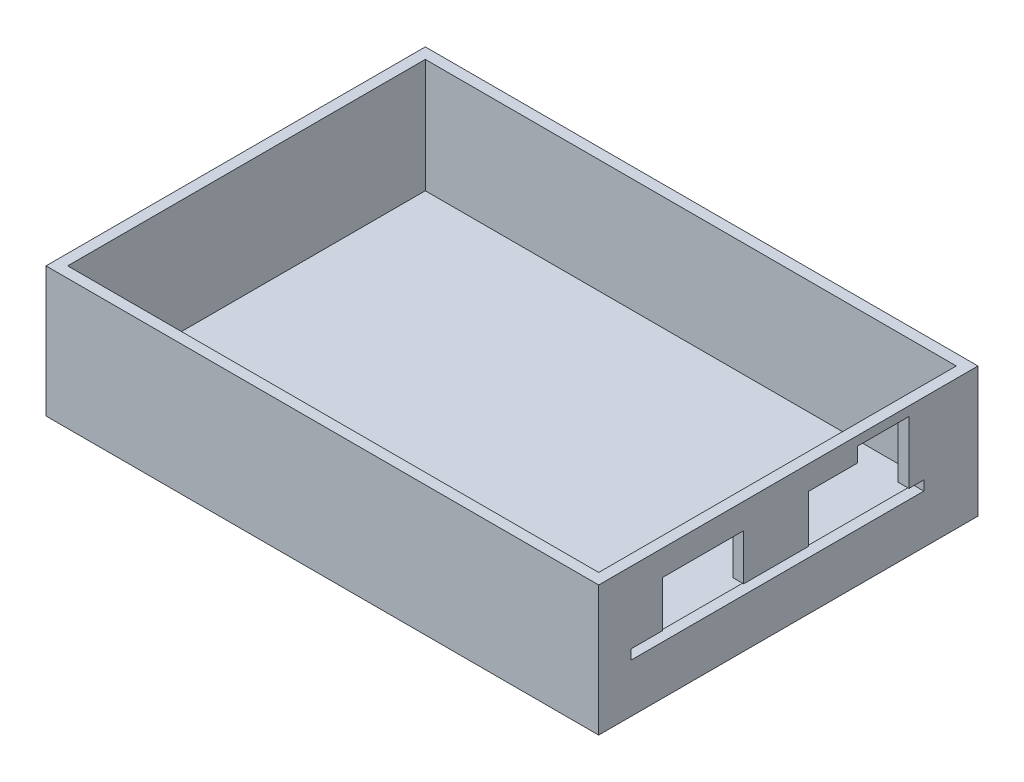
ISO-10303-21;
HEADER;
FILE_DESCRIPTION(('STEP AP214'),'2;1');
FILE_NAME('part.step','',(''),(''),'','','');
FILE_SCHEMA(('AUTOMOTIVE_DESIGN { 1 0 10303 214 1 1 1 1 }'));
ENDSEC;
DATA;
#1=APPLICATION_CONTEXT('core data for automotive mechanical design processes');
#2=APPLICATION_PROTOCOL_DEFINITION('international standard','automotive_design',2000,#1);
#3=PRODUCT_CONTEXT('',#1,'mechanical');
#4=PRODUCT('Part','Part','',(#3));
#5=PRODUCT_RELATED_PRODUCT_CATEGORY('part','',(#4));
#6=PRODUCT_DEFINITION_FORMATION('','',#4);
#7=PRODUCT_DEFINITION_CONTEXT('part definition',#1,'design');
#8=PRODUCT_DEFINITION('design','',#6,#7);
#9=PRODUCT_DEFINITION_SHAPE('','',#8);
#10=(LENGTH_UNIT() NAMED_UNIT(*) SI_UNIT(.MILLI.,.METRE.));
#11=(NAMED_UNIT(*) PLANE_ANGLE_UNIT() SI_UNIT($,.RADIAN.));
#12=(NAMED_UNIT(*) SI_UNIT($,.STERADIAN.) SOLID_ANGLE_UNIT());
#13=UNCERTAINTY_MEASURE_WITH_UNIT(LENGTH_MEASURE(1.E-05),#10,'distance_accuracy_value','');
#14=(GEOMETRIC_REPRESENTATION_CONTEXT(3) GLOBAL_UNCERTAINTY_ASSIGNED_CONTEXT((#13)) GLOBAL_UNIT_ASSIGNED_CONTEXT((#10,
#11,#12)) REPRESENTATION_CONTEXT('',''));
#15=CARTESIAN_POINT('',(0.,0.,0.));
#16=DIRECTION('',(0.,0.,1.));
#17=DIRECTION('',(1.,0.,0.));
#18=AXIS2_PLACEMENT_3D('',#15,#16,#17);
#19=CARTESIAN_POINT('',(0.,24.,0.));
#20=DIRECTION('',(1.,0.,0.));
#21=DIRECTION('',(0.,0.,-1.));
#22=AXIS2_PLACEMENT_3D('',#19,#20,#21);
#23=PLANE('',#22);
#24=DIRECTION('',(0.,0.,1.));
#25=VECTOR('',#24,1.);
#26=CARTESIAN_POINT('',(0.,0.,0.));
#27=LINE('',#26,#25);
#28=CARTESIAN_POINT('',(0.,0.,-70.));
#29=VERTEX_POINT('',#28);
#30=CARTESIAN_POINT('',(0.,0.,0.));
#31=VERTEX_POINT('',#30);
#32=EDGE_CURVE('E297',#29,#31,#27,.T.);
#33=ORIENTED_EDGE('',*,*,#32,.T.);
#34=DIRECTION('',(0.,-1.,0.));
#35=VECTOR('',#34,1.);
#36=CARTESIAN_POINT('',(0.,24.,0.));
#37=LINE('',#36,#35);
#38=CARTESIAN_POINT('',(0.,24.,0.));
#39=VERTEX_POINT('',#38);
#40=EDGE_CURVE('E12',#39,#31,#37,.T.);
#41=ORIENTED_EDGE('',*,*,#40,.F.);
#42=DIRECTION('',(0.,0.,1.));
#43=VECTOR('',#42,1.);
#44=CARTESIAN_POINT('',(0.,24.,0.));
#45=LINE('',#44,#43);
#46=CARTESIAN_POINT('',(0.,24.,-70.));
#47=VERTEX_POINT('',#46);
#48=EDGE_CURVE('E298',#47,#39,#45,.T.);
#49=ORIENTED_EDGE('',*,*,#48,.F.);
#50=DIRECTION('',(0.,-1.,0.));
#51=VECTOR('',#50,1.);
#52=CARTESIAN_POINT('',(0.,24.,-70.));
#53=LINE('',#52,#51);
#54=EDGE_CURVE('E308',#47,#29,#53,.T.);
#55=ORIENTED_EDGE('',*,*,#54,.T.);
#56=EDGE_LOOP('',(#33,#41,#49,#55));
#57=FACE_BOUND('',#56,.T.);
#58=ADVANCED_FACE('F35',(#57),#23,.F.);
#59=CARTESIAN_POINT('',(0.,24.,0.));
#60=DIRECTION('',(0.,0.,-1.));
#61=DIRECTION('',(-1.,0.,0.));
#62=AXIS2_PLACEMENT_3D('',#59,#60,#61);
#63=PLANE('',#62);
#64=DIRECTION('',(1.,0.,0.));
#65=VECTOR('',#64,1.);
#66=CARTESIAN_POINT('',(0.,0.,0.));
#67=LINE('',#66,#65);
#68=CARTESIAN_POINT('',(102.,0.,0.));
#69=VERTEX_POINT('',#68);
#70=EDGE_CURVE('E311',#31,#69,#67,.T.);
#71=ORIENTED_EDGE('',*,*,#70,.T.);
#72=DIRECTION('',(0.,-1.,0.));
#73=VECTOR('',#72,1.);
#74=CARTESIAN_POINT('',(102.,24.,0.));
#75=LINE('',#74,#73);
#76=CARTESIAN_POINT('',(102.,24.,0.));
#77=VERTEX_POINT('',#76);
#78=EDGE_CURVE('E42',#77,#69,#75,.T.);
#79=ORIENTED_EDGE('',*,*,#78,.F.);
#80=DIRECTION('',(1.,0.,0.));
#81=VECTOR('',#80,1.);
#82=CARTESIAN_POINT('',(0.,24.,0.));
#83=LINE('',#82,#81);
#84=EDGE_CURVE('E301',#39,#77,#83,.T.);
#85=ORIENTED_EDGE('',*,*,#84,.F.);
#86=ORIENTED_EDGE('',*,*,#40,.T.);
#87=EDGE_LOOP('',(#71,#79,#85,#86));
#88=FACE_BOUND('',#87,.T.);
#89=ADVANCED_FACE('F339',(#88),#63,.F.);
#90=CARTESIAN_POINT('',(102.,24.,0.));
#91=DIRECTION('',(-1.,0.,0.));
#92=DIRECTION('',(0.,0.,1.));
#93=AXIS2_PLACEMENT_3D('',#90,#91,#92);
#94=PLANE('',#93);
#95=DIRECTION('',(0.,0.,-1.));
#96=VECTOR('',#95,1.);
#97=CARTESIAN_POINT('',(102.,9.,-6.00000000000001));
#98=LINE('',#97,#96);
#99=CARTESIAN_POINT('',(102.,9.,-6.00000000000001));
#100=VERTEX_POINT('',#99);
#101=CARTESIAN_POINT('',(102.,9.,-60.));
#102=VERTEX_POINT('',#101);
#103=EDGE_CURVE('E195',#100,#102,#98,.T.);
#104=ORIENTED_EDGE('',*,*,#103,.F.);
#105=DIRECTION('',(0.,-1.,0.));
#106=VECTOR('',#105,1.);
#107=CARTESIAN_POINT('',(102.,10.8,-6.));
#108=LINE('',#107,#106);
#109=CARTESIAN_POINT('',(102.,10.8,-6.));
#110=VERTEX_POINT('',#109);
#111=EDGE_CURVE('E49',#110,#100,#108,.T.);
#112=ORIENTED_EDGE('',*,*,#111,.F.);
#113=DIRECTION('',(0.,0.,1.));
#114=VECTOR('',#113,1.);
#115=CARTESIAN_POINT('',(102.,10.8,-11.75));
#116=LINE('',#115,#114);
#117=CARTESIAN_POINT('',(102.,10.8,-11.75));
#118=VERTEX_POINT('',#117);
#119=EDGE_CURVE('E235',#118,#110,#116,.T.);
#120=ORIENTED_EDGE('',*,*,#119,.F.);
#121=DIRECTION('',(0.,-1.,0.));
#122=VECTOR('',#121,1.);
#123=CARTESIAN_POINT('',(102.,19.3,-11.75));
#124=LINE('',#123,#122);
#125=CARTESIAN_POINT('',(102.,19.3,-11.75));
#126=VERTEX_POINT('',#125);
#127=EDGE_CURVE('E232',#126,#118,#124,.T.);
#128=ORIENTED_EDGE('',*,*,#127,.F.);
#129=DIRECTION('',(0.,0.,1.));
#130=VECTOR('',#129,1.);
#131=CARTESIAN_POINT('',(102.,19.3,-26.75));
#132=LINE('',#131,#130);
#133=CARTESIAN_POINT('',(102.,19.3,-26.75));
#134=VERTEX_POINT('',#133);
#135=EDGE_CURVE('E229',#134,#126,#132,.T.);
#136=ORIENTED_EDGE('',*,*,#135,.F.);
#137=DIRECTION('',(0.,1.,0.));
#138=VECTOR('',#137,1.);
#139=CARTESIAN_POINT('',(102.,10.8,-26.75));
#140=LINE('',#139,#138);
#141=CARTESIAN_POINT('',(102.,10.8,-26.75));
#142=VERTEX_POINT('',#141);
#143=EDGE_CURVE('E226',#142,#134,#140,.T.);
#144=ORIENTED_EDGE('',*,*,#143,.F.);
#145=DIRECTION('',(0.,0.,1.));
#146=VECTOR('',#145,1.);
#147=CARTESIAN_POINT('',(102.,10.8,-38.75));
#148=LINE('',#147,#146);
#149=CARTESIAN_POINT('',(102.,10.8,-38.75));
#150=VERTEX_POINT('',#149);
#151=EDGE_CURVE('E223',#150,#142,#148,.T.);
#152=ORIENTED_EDGE('',*,*,#151,.F.);
#153=DIRECTION('',(0.,-1.,0.));
#154=VECTOR('',#153,1.);
#155=CARTESIAN_POINT('',(102.,19.6,-38.75));
#156=LINE('',#155,#154);
#157=CARTESIAN_POINT('',(102.,19.6,-38.75));
#158=VERTEX_POINT('',#157);
#159=EDGE_CURVE('E220',#158,#150,#156,.T.);
#160=ORIENTED_EDGE('',*,*,#159,.F.);
#161=DIRECTION('',(0.,0.,1.));
#162=VECTOR('',#161,1.);
#163=CARTESIAN_POINT('',(102.,19.6,-47.75));
#164=LINE('',#163,#162);
#165=CARTESIAN_POINT('',(102.,19.6,-47.75));
#166=VERTEX_POINT('',#165);
#167=EDGE_CURVE('E217',#166,#158,#164,.T.);
#168=ORIENTED_EDGE('',*,*,#167,.F.);
#169=DIRECTION('',(0.,-1.,0.));
#170=VECTOR('',#169,1.);
#171=CARTESIAN_POINT('',(102.,22.3,-47.75));
#172=LINE('',#171,#170);
#173=CARTESIAN_POINT('',(102.,22.3,-47.75));
#174=VERTEX_POINT('',#173);
#175=EDGE_CURVE('E214',#174,#166,#172,.T.);
#176=ORIENTED_EDGE('',*,*,#175,.F.);
#177=DIRECTION('',(0.,0.,1.));
#178=VECTOR('',#177,1.);
#179=CARTESIAN_POINT('',(102.,22.3,-57.25));
#180=LINE('',#179,#178);
#181=CARTESIAN_POINT('',(102.,22.3,-57.25));
#182=VERTEX_POINT('',#181);
#183=EDGE_CURVE('E211',#182,#174,#180,.T.);
#184=ORIENTED_EDGE('',*,*,#183,.F.);
#185=DIRECTION('',(0.,1.,0.));
#186=VECTOR('',#185,1.);
#187=CARTESIAN_POINT('',(102.,10.8,-57.25));
#188=LINE('',#187,#186);
#189=CARTESIAN_POINT('',(102.,10.8,-57.25));
#190=VERTEX_POINT('',#189);
#191=EDGE_CURVE('E205',#190,#182,#188,.T.);
#192=ORIENTED_EDGE('',*,*,#191,.F.);
#193=DIRECTION('',(0.,0.,1.));
#194=VECTOR('',#193,1.);
#195=CARTESIAN_POINT('',(102.,10.8,-60.));
#196=LINE('',#195,#194);
#197=CARTESIAN_POINT('',(102.,10.8,-60.));
#198=VERTEX_POINT('',#197);
#199=EDGE_CURVE('E203',#198,#190,#196,.T.);
#200=ORIENTED_EDGE('',*,*,#199,.F.);
#201=DIRECTION('',(0.,1.,0.));
#202=VECTOR('',#201,1.);
#203=CARTESIAN_POINT('',(102.,9.,-60.));
#204=LINE('',#203,#202);
#205=EDGE_CURVE('E186',#102,#198,#204,.T.);
#206=ORIENTED_EDGE('',*,*,#205,.F.);
#207=EDGE_LOOP('',(#104,#112,#120,#128,#136,#144,#152,#160,#168,#176,#184,#192,#200,#206));
#208=FACE_BOUND('',#207,.T.);
#209=DIRECTION('',(0.,0.,-1.));
#210=VECTOR('',#209,1.);
#211=CARTESIAN_POINT('',(102.,0.,0.));
#212=LINE('',#211,#210);
#213=CARTESIAN_POINT('',(102.,0.,-70.));
#214=VERTEX_POINT('',#213);
#215=EDGE_CURVE('E313',#69,#214,#212,.T.);
#216=ORIENTED_EDGE('',*,*,#215,.T.);
#217=DIRECTION('',(0.,-1.,0.));
#218=VECTOR('',#217,1.);
#219=CARTESIAN_POINT('',(102.,24.,-70.));
#220=LINE('',#219,#218);
#221=CARTESIAN_POINT('',(102.,24.,-70.));
#222=VERTEX_POINT('',#221);
#223=EDGE_CURVE('E318',#222,#214,#220,.T.);
#224=ORIENTED_EDGE('',*,*,#223,.F.);
#225=DIRECTION('',(0.,0.,-1.));
#226=VECTOR('',#225,1.);
#227=CARTESIAN_POINT('',(102.,24.,0.));
#228=LINE('',#227,#226);
#229=EDGE_CURVE('E304',#77,#222,#228,.T.);
#230=ORIENTED_EDGE('',*,*,#229,.F.);
#231=ORIENTED_EDGE('',*,*,#78,.T.);
#232=EDGE_LOOP('',(#216,#224,#230,#231));
#233=FACE_BOUND('',#232,.T.);
#234=ADVANCED_FACE('F199',(#208,#233),#94,.F.);
#235=CARTESIAN_POINT('',(0.,24.,-70.));
#236=DIRECTION('',(0.,0.,1.));
#237=DIRECTION('',(1.,0.,0.));
#238=AXIS2_PLACEMENT_3D('',#235,#236,#237);
#239=PLANE('',#238);
#240=DIRECTION('',(-1.,0.,0.));
#241=VECTOR('',#240,1.);
#242=CARTESIAN_POINT('',(0.,0.,-70.));
#243=LINE('',#242,#241);
#244=EDGE_CURVE('E302',#214,#29,#243,.T.);
#245=ORIENTED_EDGE('',*,*,#244,.T.);
#246=ORIENTED_EDGE('',*,*,#54,.F.);
#247=DIRECTION('',(-1.,0.,0.));
#248=VECTOR('',#247,1.);
#249=CARTESIAN_POINT('',(0.,24.,-70.));
#250=LINE('',#249,#248);
#251=EDGE_CURVE('E306',#222,#47,#250,.T.);
#252=ORIENTED_EDGE('',*,*,#251,.F.);
#253=ORIENTED_EDGE('',*,*,#223,.T.);
#254=EDGE_LOOP('',(#245,#246,#252,#253));
#255=FACE_BOUND('',#254,.T.);
#256=ADVANCED_FACE('F332',(#255),#239,.F.);
#257=CARTESIAN_POINT('',(0.,24.,0.));
#258=DIRECTION('',(0.,-1.,0.));
#259=DIRECTION('',(0.,0.,-1.));
#260=AXIS2_PLACEMENT_3D('',#257,#258,#259);
#261=PLANE('',#260);
#262=DIRECTION('',(0.,0.,-1.));
#263=VECTOR('',#262,1.);
#264=CARTESIAN_POINT('',(100.,24.,-2.));
#265=LINE('',#264,#263);
#266=CARTESIAN_POINT('',(100.,24.,-2.));
#267=VERTEX_POINT('',#266);
#268=CARTESIAN_POINT('',(100.,24.,-68.));
#269=VERTEX_POINT('',#268);
#270=EDGE_CURVE('E269',#267,#269,#265,.T.);
#271=ORIENTED_EDGE('',*,*,#270,.F.);
#272=DIRECTION('',(1.,0.,0.));
#273=VECTOR('',#272,1.);
#274=CARTESIAN_POINT('',(2.,24.,-2.));
#275=LINE('',#274,#273);
#276=CARTESIAN_POINT('',(2.,24.,-2.));
#277=VERTEX_POINT('',#276);
#278=EDGE_CURVE('E272',#277,#267,#275,.T.);
#279=ORIENTED_EDGE('',*,*,#278,.F.);
#280=DIRECTION('',(0.,0.,1.));
#281=VECTOR('',#280,1.);
#282=CARTESIAN_POINT('',(2.,24.,-2.));
#283=LINE('',#282,#281);
#284=CARTESIAN_POINT('',(2.,24.,-68.));
#285=VERTEX_POINT('',#284);
#286=EDGE_CURVE('E264',#285,#277,#283,.T.);
#287=ORIENTED_EDGE('',*,*,#286,.F.);
#288=DIRECTION('',(-1.,0.,0.));
#289=VECTOR('',#288,1.);
#290=CARTESIAN_POINT('',(2.,24.,-68.));
#291=LINE('',#290,#289);
#292=EDGE_CURVE('E266',#269,#285,#291,.T.);
#293=ORIENTED_EDGE('',*,*,#292,.F.);
#294=EDGE_LOOP('',(#271,#279,#287,#293));
#295=FACE_BOUND('',#294,.T.);
#296=ORIENTED_EDGE('',*,*,#48,.T.);
#297=ORIENTED_EDGE('',*,*,#84,.T.);
#298=ORIENTED_EDGE('',*,*,#229,.T.);
#299=ORIENTED_EDGE('',*,*,#251,.T.);
#300=EDGE_LOOP('',(#296,#297,#298,#299));
#301=FACE_BOUND('',#300,.T.);
#302=ADVANCED_FACE('F338',(#295,#301),#261,.F.);
#303=CARTESIAN_POINT('',(0.,0.,0.));
#304=DIRECTION('',(0.,-1.,0.));
#305=DIRECTION('',(0.,0.,-1.));
#306=AXIS2_PLACEMENT_3D('',#303,#304,#305);
#307=PLANE('',#306);
#308=ORIENTED_EDGE('',*,*,#32,.F.);
#309=ORIENTED_EDGE('',*,*,#244,.F.);
#310=ORIENTED_EDGE('',*,*,#215,.F.);
#311=ORIENTED_EDGE('',*,*,#70,.F.);
#312=EDGE_LOOP('',(#308,#309,#310,#311));
#313=FACE_BOUND('',#312,.T.);
#314=ADVANCED_FACE('F329',(#313),#307,.T.);
#315=CARTESIAN_POINT('',(0.,3.,0.));
#316=DIRECTION('',(0.,-1.,0.));
#317=DIRECTION('',(0.,0.,-1.));
#318=AXIS2_PLACEMENT_3D('',#315,#316,#317);
#319=PLANE('',#318);
#320=DIRECTION('',(0.,0.,1.));
#321=VECTOR('',#320,1.);
#322=CARTESIAN_POINT('',(2.,3.,-2.));
#323=LINE('',#322,#321);
#324=CARTESIAN_POINT('',(2.,3.,-68.));
#325=VERTEX_POINT('',#324);
#326=CARTESIAN_POINT('',(2.,3.,-2.));
#327=VERTEX_POINT('',#326);
#328=EDGE_CURVE('E280',#325,#327,#323,.T.);
#329=ORIENTED_EDGE('',*,*,#328,.T.);
#330=DIRECTION('',(1.,0.,0.));
#331=VECTOR('',#330,1.);
#332=CARTESIAN_POINT('',(2.,3.,-2.));
#333=LINE('',#332,#331);
#334=CARTESIAN_POINT('',(100.,3.,-2.));
#335=VERTEX_POINT('',#334);
#336=EDGE_CURVE('E268',#327,#335,#333,.T.);
#337=ORIENTED_EDGE('',*,*,#336,.T.);
#338=DIRECTION('',(0.,0.,-1.));
#339=VECTOR('',#338,1.);
#340=CARTESIAN_POINT('',(100.,3.,-2.));
#341=LINE('',#340,#339);
#342=CARTESIAN_POINT('',(100.,3.,-68.));
#343=VERTEX_POINT('',#342);
#344=EDGE_CURVE('E289',#335,#343,#341,.T.);
#345=ORIENTED_EDGE('',*,*,#344,.T.);
#346=DIRECTION('',(-1.,0.,0.));
#347=VECTOR('',#346,1.);
#348=CARTESIAN_POINT('',(2.,3.,-68.));
#349=LINE('',#348,#347);
#350=EDGE_CURVE('E285',#343,#325,#349,.T.);
#351=ORIENTED_EDGE('',*,*,#350,.T.);
#352=EDGE_LOOP('',(#329,#337,#345,#351));
#353=FACE_BOUND('',#352,.T.);
#354=ADVANCED_FACE('F351',(#353),#319,.F.);
#355=CARTESIAN_POINT('',(2.,-118.152443901935,-2.));
#356=DIRECTION('',(0.,0.,1.));
#357=DIRECTION('',(1.,0.,0.));
#358=AXIS2_PLACEMENT_3D('',#355,#356,#357);
#359=PLANE('',#358);
#360=DIRECTION('',(0.,1.,0.));
#361=VECTOR('',#360,1.);
#362=CARTESIAN_POINT('',(2.,-118.152443901935,-2.));
#363=LINE('',#362,#361);
#364=EDGE_CURVE('E283',#327,#277,#363,.T.);
#365=ORIENTED_EDGE('',*,*,#364,.T.);
#366=ORIENTED_EDGE('',*,*,#278,.T.);
#367=DIRECTION('',(0.,1.,0.));
#368=VECTOR('',#367,1.);
#369=CARTESIAN_POINT('',(100.,-118.152443901935,-2.));
#370=LINE('',#369,#368);
#371=EDGE_CURVE('E279',#335,#267,#370,.T.);
#372=ORIENTED_EDGE('',*,*,#371,.F.);
#373=ORIENTED_EDGE('',*,*,#336,.F.);
#374=EDGE_LOOP('',(#365,#366,#372,#373));
#375=FACE_BOUND('',#374,.T.);
#376=ADVANCED_FACE('F357',(#375),#359,.F.);
#377=CARTESIAN_POINT('',(100.,-118.152443901935,-2.));
#378=DIRECTION('',(1.,0.,0.));
#379=DIRECTION('',(0.,0.,-1.));
#380=AXIS2_PLACEMENT_3D('',#377,#378,#379);
#381=PLANE('',#380);
#382=DIRECTION('',(0.,0.,-1.));
#383=VECTOR('',#382,1.);
#384=CARTESIAN_POINT('',(100.,10.8,-11.75));
#385=LINE('',#384,#383);
#386=CARTESIAN_POINT('',(100.,10.8,-6.));
#387=VERTEX_POINT('',#386);
#388=CARTESIAN_POINT('',(100.,10.8,-11.75));
#389=VERTEX_POINT('',#388);
#390=EDGE_CURVE('E428',#387,#389,#385,.T.);
#391=ORIENTED_EDGE('',*,*,#390,.F.);
#392=DIRECTION('',(0.,1.,0.));
#393=VECTOR('',#392,1.);
#394=CARTESIAN_POINT('',(100.,10.8,-6.));
#395=LINE('',#394,#393);
#396=CARTESIAN_POINT('',(100.,9.,-6.00000000000001));
#397=VERTEX_POINT('',#396);
#398=EDGE_CURVE('E265',#397,#387,#395,.T.);
#399=ORIENTED_EDGE('',*,*,#398,.F.);
#400=DIRECTION('',(0.,0.,1.));
#401=VECTOR('',#400,1.);
#402=CARTESIAN_POINT('',(100.,9.,-6.00000000000001));
#403=LINE('',#402,#401);
#404=CARTESIAN_POINT('',(100.,9.00000000000001,-60.));
#405=VERTEX_POINT('',#404);
#406=EDGE_CURVE('E262',#405,#397,#403,.T.);
#407=ORIENTED_EDGE('',*,*,#406,.F.);
#408=DIRECTION('',(0.,-1.,0.));
#409=VECTOR('',#408,1.);
#410=CARTESIAN_POINT('',(100.,9.,-60.));
#411=LINE('',#410,#409);
#412=CARTESIAN_POINT('',(100.,10.8,-60.));
#413=VERTEX_POINT('',#412);
#414=EDGE_CURVE('E189',#413,#405,#411,.T.);
#415=ORIENTED_EDGE('',*,*,#414,.F.);
#416=DIRECTION('',(0.,0.,-1.));
#417=VECTOR('',#416,1.);
#418=CARTESIAN_POINT('',(100.,10.8,-60.));
#419=LINE('',#418,#417);
#420=CARTESIAN_POINT('',(100.,10.8,-57.25));
#421=VERTEX_POINT('',#420);
#422=EDGE_CURVE('E448',#421,#413,#419,.T.);
#423=ORIENTED_EDGE('',*,*,#422,.F.);
#424=DIRECTION('',(0.,-1.,0.));
#425=VECTOR('',#424,1.);
#426=CARTESIAN_POINT('',(100.,10.8,-57.25));
#427=LINE('',#426,#425);
#428=CARTESIAN_POINT('',(100.,22.3,-57.25));
#429=VERTEX_POINT('',#428);
#430=EDGE_CURVE('E450',#429,#421,#427,.T.);
#431=ORIENTED_EDGE('',*,*,#430,.F.);
#432=DIRECTION('',(0.,0.,-1.));
#433=VECTOR('',#432,1.);
#434=CARTESIAN_POINT('',(100.,22.3,-57.25));
#435=LINE('',#434,#433);
#436=CARTESIAN_POINT('',(100.,22.3,-47.75));
#437=VERTEX_POINT('',#436);
#438=EDGE_CURVE('E454',#437,#429,#435,.T.);
#439=ORIENTED_EDGE('',*,*,#438,.F.);
#440=DIRECTION('',(0.,1.,0.));
#441=VECTOR('',#440,1.);
#442=CARTESIAN_POINT('',(100.,22.3,-47.75));
#443=LINE('',#442,#441);
#444=CARTESIAN_POINT('',(100.,19.6,-47.75));
#445=VERTEX_POINT('',#444);
#446=EDGE_CURVE('E456',#445,#437,#443,.T.);
#447=ORIENTED_EDGE('',*,*,#446,.F.);
#448=DIRECTION('',(0.,0.,-1.));
#449=VECTOR('',#448,1.);
#450=CARTESIAN_POINT('',(100.,19.6,-47.75));
#451=LINE('',#450,#449);
#452=CARTESIAN_POINT('',(100.,19.6,-38.75));
#453=VERTEX_POINT('',#452);
#454=EDGE_CURVE('E458',#453,#445,#451,.T.);
#455=ORIENTED_EDGE('',*,*,#454,.F.);
#456=DIRECTION('',(0.,1.,0.));
#457=VECTOR('',#456,1.);
#458=CARTESIAN_POINT('',(100.,19.6,-38.75));
#459=LINE('',#458,#457);
#460=CARTESIAN_POINT('',(100.,10.8,-38.75));
#461=VERTEX_POINT('',#460);
#462=EDGE_CURVE('E460',#461,#453,#459,.T.);
#463=ORIENTED_EDGE('',*,*,#462,.F.);
#464=DIRECTION('',(0.,0.,-1.));
#465=VECTOR('',#464,1.);
#466=CARTESIAN_POINT('',(100.,10.8,-38.75));
#467=LINE('',#466,#465);
#468=CARTESIAN_POINT('',(100.,10.8,-26.75));
#469=VERTEX_POINT('',#468);
#470=EDGE_CURVE('E462',#469,#461,#467,.T.);
#471=ORIENTED_EDGE('',*,*,#470,.F.);
#472=DIRECTION('',(0.,-1.,0.));
#473=VECTOR('',#472,1.);
#474=CARTESIAN_POINT('',(100.,10.8,-26.75));
#475=LINE('',#474,#473);
#476=CARTESIAN_POINT('',(100.,19.3,-26.75));
#477=VERTEX_POINT('',#476);
#478=EDGE_CURVE('E442',#477,#469,#475,.T.);
#479=ORIENTED_EDGE('',*,*,#478,.F.);
#480=DIRECTION('',(0.,0.,-1.));
#481=VECTOR('',#480,1.);
#482=CARTESIAN_POINT('',(100.,19.3,-26.75));
#483=LINE('',#482,#481);
#484=CARTESIAN_POINT('',(100.,19.3,-11.75));
#485=VERTEX_POINT('',#484);
#486=EDGE_CURVE('E440',#485,#477,#483,.T.);
#487=ORIENTED_EDGE('',*,*,#486,.F.);
#488=DIRECTION('',(0.,1.,0.));
#489=VECTOR('',#488,1.);
#490=CARTESIAN_POINT('',(100.,19.3,-11.75));
#491=LINE('',#490,#489);
#492=EDGE_CURVE('E432',#389,#485,#491,.T.);
#493=ORIENTED_EDGE('',*,*,#492,.F.);
#494=EDGE_LOOP('',(#391,#399,#407,#415,#423,#431,#439,#447,#455,#463,#471,#479,#487,#493));
#495=FACE_BOUND('',#494,.T.);
#496=ORIENTED_EDGE('',*,*,#371,.T.);
#497=ORIENTED_EDGE('',*,*,#270,.T.);
#498=DIRECTION('',(0.,1.,0.));
#499=VECTOR('',#498,1.);
#500=CARTESIAN_POINT('',(100.,-118.152443901935,-68.));
#501=LINE('',#500,#499);
#502=EDGE_CURVE('E288',#343,#269,#501,.T.);
#503=ORIENTED_EDGE('',*,*,#502,.F.);
#504=ORIENTED_EDGE('',*,*,#344,.F.);
#505=EDGE_LOOP('',(#496,#497,#503,#504));
#506=FACE_BOUND('',#505,.T.);
#507=ADVANCED_FACE('F361',(#495,#506),#381,.F.);
#508=CARTESIAN_POINT('',(2.,-118.152443901935,-68.));
#509=DIRECTION('',(0.,0.,-1.));
#510=DIRECTION('',(-1.,0.,0.));
#511=AXIS2_PLACEMENT_3D('',#508,#509,#510);
#512=PLANE('',#511);
#513=ORIENTED_EDGE('',*,*,#502,.T.);
#514=ORIENTED_EDGE('',*,*,#292,.T.);
#515=DIRECTION('',(0.,1.,0.));
#516=VECTOR('',#515,1.);
#517=CARTESIAN_POINT('',(2.,-118.152443901935,-68.));
#518=LINE('',#517,#516);
#519=EDGE_CURVE('E284',#325,#285,#518,.T.);
#520=ORIENTED_EDGE('',*,*,#519,.F.);
#521=ORIENTED_EDGE('',*,*,#350,.F.);
#522=EDGE_LOOP('',(#513,#514,#520,#521));
#523=FACE_BOUND('',#522,.T.);
#524=ADVANCED_FACE('F365',(#523),#512,.F.);
#525=CARTESIAN_POINT('',(2.,-118.152443901935,-2.));
#526=DIRECTION('',(-1.,0.,0.));
#527=DIRECTION('',(0.,0.,1.));
#528=AXIS2_PLACEMENT_3D('',#525,#526,#527);
#529=PLANE('',#528);
#530=ORIENTED_EDGE('',*,*,#519,.T.);
#531=ORIENTED_EDGE('',*,*,#286,.T.);
#532=ORIENTED_EDGE('',*,*,#364,.F.);
#533=ORIENTED_EDGE('',*,*,#328,.F.);
#534=EDGE_LOOP('',(#530,#531,#532,#533));
#535=FACE_BOUND('',#534,.T.);
#536=ADVANCED_FACE('F369',(#535),#529,.F.);
#537=CARTESIAN_POINT('',(44.3862427092001,10.8,-6.));
#538=DIRECTION('',(0.,0.,1.));
#539=DIRECTION('',(0.,-1.,0.));
#540=AXIS2_PLACEMENT_3D('',#537,#538,#539);
#541=PLANE('',#540);
#542=ORIENTED_EDGE('',*,*,#398,.T.);
#543=DIRECTION('',(1.,0.,0.));
#544=VECTOR('',#543,1.);
#545=CARTESIAN_POINT('',(44.3862427092001,10.8,-6.));
#546=LINE('',#545,#544);
#547=EDGE_CURVE('E238',#387,#110,#546,.T.);
#548=ORIENTED_EDGE('',*,*,#547,.T.);
#549=ORIENTED_EDGE('',*,*,#111,.T.);
#550=DIRECTION('',(1.,0.,0.));
#551=VECTOR('',#550,1.);
#552=CARTESIAN_POINT('',(44.3862427092001,9.,-6.00000000000001));
#553=LINE('',#552,#551);
#554=EDGE_CURVE('E192',#397,#100,#553,.T.);
#555=ORIENTED_EDGE('',*,*,#554,.F.);
#556=EDGE_LOOP('',(#542,#548,#549,#555));
#557=FACE_BOUND('',#556,.T.);
#558=ADVANCED_FACE('F373',(#557),#541,.F.);
#559=CARTESIAN_POINT('',(44.3862427092001,10.8,-11.75));
#560=DIRECTION('',(0.,1.,0.));
#561=DIRECTION('',(0.,0.,1.));
#562=AXIS2_PLACEMENT_3D('',#559,#560,#561);
#563=PLANE('',#562);
#564=ORIENTED_EDGE('',*,*,#390,.T.);
#565=DIRECTION('',(1.,0.,0.));
#566=VECTOR('',#565,1.);
#567=CARTESIAN_POINT('',(44.3862427092001,10.8,-11.75));
#568=LINE('',#567,#566);
#569=EDGE_CURVE('E240',#389,#118,#568,.T.);
#570=ORIENTED_EDGE('',*,*,#569,.T.);
#571=ORIENTED_EDGE('',*,*,#119,.T.);
#572=ORIENTED_EDGE('',*,*,#547,.F.);
#573=EDGE_LOOP('',(#564,#570,#571,#572));
#574=FACE_BOUND('',#573,.T.);
#575=ADVANCED_FACE('F377',(#574),#563,.F.);
#576=CARTESIAN_POINT('',(44.3862427092001,19.3,-11.75));
#577=DIRECTION('',(0.,0.,1.));
#578=DIRECTION('',(0.,-1.,0.));
#579=AXIS2_PLACEMENT_3D('',#576,#577,#578);
#580=PLANE('',#579);
#581=ORIENTED_EDGE('',*,*,#492,.T.);
#582=DIRECTION('',(1.,0.,0.));
#583=VECTOR('',#582,1.);
#584=CARTESIAN_POINT('',(44.3862427092001,19.3,-11.75));
#585=LINE('',#584,#583);
#586=EDGE_CURVE('E242',#485,#126,#585,.T.);
#587=ORIENTED_EDGE('',*,*,#586,.T.);
#588=ORIENTED_EDGE('',*,*,#127,.T.);
#589=ORIENTED_EDGE('',*,*,#569,.F.);
#590=EDGE_LOOP('',(#581,#587,#588,#589));
#591=FACE_BOUND('',#590,.T.);
#592=ADVANCED_FACE('F417',(#591),#580,.F.);
#593=CARTESIAN_POINT('',(44.3862427092001,19.3,-26.75));
#594=DIRECTION('',(0.,1.,0.));
#595=DIRECTION('',(0.,0.,1.));
#596=AXIS2_PLACEMENT_3D('',#593,#594,#595);
#597=PLANE('',#596);
#598=ORIENTED_EDGE('',*,*,#486,.T.);
#599=DIRECTION('',(1.,0.,0.));
#600=VECTOR('',#599,1.);
#601=CARTESIAN_POINT('',(44.3862427092001,19.3,-26.75));
#602=LINE('',#601,#600);
#603=EDGE_CURVE('E244',#477,#134,#602,.T.);
#604=ORIENTED_EDGE('',*,*,#603,.T.);
#605=ORIENTED_EDGE('',*,*,#135,.T.);
#606=ORIENTED_EDGE('',*,*,#586,.F.);
#607=EDGE_LOOP('',(#598,#604,#605,#606));
#608=FACE_BOUND('',#607,.T.);
#609=ADVANCED_FACE('F413',(#608),#597,.F.);
#610=CARTESIAN_POINT('',(44.3862427092001,10.8,-26.75));
#611=DIRECTION('',(0.,0.,-1.));
#612=DIRECTION('',(0.,1.,0.));
#613=AXIS2_PLACEMENT_3D('',#610,#611,#612);
#614=PLANE('',#613);
#615=ORIENTED_EDGE('',*,*,#478,.T.);
#616=DIRECTION('',(1.,0.,0.));
#617=VECTOR('',#616,1.);
#618=CARTESIAN_POINT('',(44.3862427092001,10.8,-26.75));
#619=LINE('',#618,#617);
#620=EDGE_CURVE('E246',#469,#142,#619,.T.);
#621=ORIENTED_EDGE('',*,*,#620,.T.);
#622=ORIENTED_EDGE('',*,*,#143,.T.);
#623=ORIENTED_EDGE('',*,*,#603,.F.);
#624=EDGE_LOOP('',(#615,#621,#622,#623));
#625=FACE_BOUND('',#624,.T.);
#626=ADVANCED_FACE('F409',(#625),#614,.F.);
#627=CARTESIAN_POINT('',(44.3862427092001,10.8,-38.75));
#628=DIRECTION('',(0.,1.,0.));
#629=DIRECTION('',(0.,0.,1.));
#630=AXIS2_PLACEMENT_3D('',#627,#628,#629);
#631=PLANE('',#630);
#632=ORIENTED_EDGE('',*,*,#470,.T.);
#633=DIRECTION('',(1.,0.,0.));
#634=VECTOR('',#633,1.);
#635=CARTESIAN_POINT('',(44.3862427092001,10.8,-38.75));
#636=LINE('',#635,#634);
#637=EDGE_CURVE('E248',#461,#150,#636,.T.);
#638=ORIENTED_EDGE('',*,*,#637,.T.);
#639=ORIENTED_EDGE('',*,*,#151,.T.);
#640=ORIENTED_EDGE('',*,*,#620,.F.);
#641=EDGE_LOOP('',(#632,#638,#639,#640));
#642=FACE_BOUND('',#641,.T.);
#643=ADVANCED_FACE('F405',(#642),#631,.F.);
#644=CARTESIAN_POINT('',(44.3862427092001,19.6,-38.75));
#645=DIRECTION('',(0.,0.,1.));
#646=DIRECTION('',(1.,0.,0.));
#647=AXIS2_PLACEMENT_3D('',#644,#645,#646);
#648=PLANE('',#647);
#649=ORIENTED_EDGE('',*,*,#462,.T.);
#650=DIRECTION('',(1.,0.,0.));
#651=VECTOR('',#650,1.);
#652=CARTESIAN_POINT('',(44.3862427092001,19.6,-38.75));
#653=LINE('',#652,#651);
#654=EDGE_CURVE('E250',#453,#158,#653,.T.);
#655=ORIENTED_EDGE('',*,*,#654,.T.);
#656=ORIENTED_EDGE('',*,*,#159,.T.);
#657=ORIENTED_EDGE('',*,*,#637,.F.);
#658=EDGE_LOOP('',(#649,#655,#656,#657));
#659=FACE_BOUND('',#658,.T.);
#660=ADVANCED_FACE('F401',(#659),#648,.F.);
#661=CARTESIAN_POINT('',(44.3862427092001,19.6,-47.75));
#662=DIRECTION('',(0.,1.,0.));
#663=DIRECTION('',(0.,0.,1.));
#664=AXIS2_PLACEMENT_3D('',#661,#662,#663);
#665=PLANE('',#664);
#666=ORIENTED_EDGE('',*,*,#454,.T.);
#667=DIRECTION('',(1.,0.,0.));
#668=VECTOR('',#667,1.);
#669=CARTESIAN_POINT('',(44.3862427092001,19.6,-47.75));
#670=LINE('',#669,#668);
#671=EDGE_CURVE('E252',#445,#166,#670,.T.);
#672=ORIENTED_EDGE('',*,*,#671,.T.);
#673=ORIENTED_EDGE('',*,*,#167,.T.);
#674=ORIENTED_EDGE('',*,*,#654,.F.);
#675=EDGE_LOOP('',(#666,#672,#673,#674));
#676=FACE_BOUND('',#675,.T.);
#677=ADVANCED_FACE('F397',(#676),#665,.F.);
#678=CARTESIAN_POINT('',(44.3862427092001,22.3,-47.75));
#679=DIRECTION('',(0.,0.,1.));
#680=DIRECTION('',(1.,0.,0.));
#681=AXIS2_PLACEMENT_3D('',#678,#679,#680);
#682=PLANE('',#681);
#683=ORIENTED_EDGE('',*,*,#446,.T.);
#684=DIRECTION('',(1.,0.,0.));
#685=VECTOR('',#684,1.);
#686=CARTESIAN_POINT('',(44.3862427092001,22.3,-47.75));
#687=LINE('',#686,#685);
#688=EDGE_CURVE('E254',#437,#174,#687,.T.);
#689=ORIENTED_EDGE('',*,*,#688,.T.);
#690=ORIENTED_EDGE('',*,*,#175,.T.);
#691=ORIENTED_EDGE('',*,*,#671,.F.);
#692=EDGE_LOOP('',(#683,#689,#690,#691));
#693=FACE_BOUND('',#692,.T.);
#694=ADVANCED_FACE('F393',(#693),#682,.F.);
#695=CARTESIAN_POINT('',(44.3862427092001,22.3,-57.25));
#696=DIRECTION('',(0.,1.,0.));
#697=DIRECTION('',(0.,0.,1.));
#698=AXIS2_PLACEMENT_3D('',#695,#696,#697);
#699=PLANE('',#698);
#700=ORIENTED_EDGE('',*,*,#438,.T.);
#701=DIRECTION('',(1.,0.,0.));
#702=VECTOR('',#701,1.);
#703=CARTESIAN_POINT('',(44.3862427092001,22.3,-57.25));
#704=LINE('',#703,#702);
#705=EDGE_CURVE('E256',#429,#182,#704,.T.);
#706=ORIENTED_EDGE('',*,*,#705,.T.);
#707=ORIENTED_EDGE('',*,*,#183,.T.);
#708=ORIENTED_EDGE('',*,*,#688,.F.);
#709=EDGE_LOOP('',(#700,#706,#707,#708));
#710=FACE_BOUND('',#709,.T.);
#711=ADVANCED_FACE('F389',(#710),#699,.F.);
#712=CARTESIAN_POINT('',(44.3862427092001,10.8,-57.25));
#713=DIRECTION('',(0.,0.,-1.));
#714=DIRECTION('',(0.,1.,0.));
#715=AXIS2_PLACEMENT_3D('',#712,#713,#714);
#716=PLANE('',#715);
#717=ORIENTED_EDGE('',*,*,#430,.T.);
#718=DIRECTION('',(1.,0.,0.));
#719=VECTOR('',#718,1.);
#720=CARTESIAN_POINT('',(44.3862427092001,10.8,-57.25));
#721=LINE('',#720,#719);
#722=EDGE_CURVE('E258',#421,#190,#721,.T.);
#723=ORIENTED_EDGE('',*,*,#722,.T.);
#724=ORIENTED_EDGE('',*,*,#191,.T.);
#725=ORIENTED_EDGE('',*,*,#705,.F.);
#726=EDGE_LOOP('',(#717,#723,#724,#725));
#727=FACE_BOUND('',#726,.T.);
#728=ADVANCED_FACE('F385',(#727),#716,.F.);
#729=CARTESIAN_POINT('',(44.3862427092001,10.8,-60.));
#730=DIRECTION('',(0.,1.,0.));
#731=DIRECTION('',(0.,0.,1.));
#732=AXIS2_PLACEMENT_3D('',#729,#730,#731);
#733=PLANE('',#732);
#734=ORIENTED_EDGE('',*,*,#422,.T.);
#735=DIRECTION('',(1.,0.,0.));
#736=VECTOR('',#735,1.);
#737=CARTESIAN_POINT('',(44.3862427092001,10.8,-60.));
#738=LINE('',#737,#736);
#739=EDGE_CURVE('E191',#413,#198,#738,.T.);
#740=ORIENTED_EDGE('',*,*,#739,.T.);
#741=ORIENTED_EDGE('',*,*,#199,.T.);
#742=ORIENTED_EDGE('',*,*,#722,.F.);
#743=EDGE_LOOP('',(#734,#740,#741,#742));
#744=FACE_BOUND('',#743,.T.);
#745=ADVANCED_FACE('F382',(#744),#733,.F.);
#746=CARTESIAN_POINT('',(44.3862427092001,9.,-60.));
#747=DIRECTION('',(0.,0.,-1.));
#748=DIRECTION('',(-1.,0.,0.));
#749=AXIS2_PLACEMENT_3D('',#746,#747,#748);
#750=PLANE('',#749);
#751=ORIENTED_EDGE('',*,*,#414,.T.);
#752=DIRECTION('',(1.,0.,0.));
#753=VECTOR('',#752,1.);
#754=CARTESIAN_POINT('',(44.3862427092001,9.,-60.));
#755=LINE('',#754,#753);
#756=EDGE_CURVE('E57',#405,#102,#755,.T.);
#757=ORIENTED_EDGE('',*,*,#756,.T.);
#758=ORIENTED_EDGE('',*,*,#205,.T.);
#759=ORIENTED_EDGE('',*,*,#739,.F.);
#760=EDGE_LOOP('',(#751,#757,#758,#759));
#761=FACE_BOUND('',#760,.T.);
#762=ADVANCED_FACE('F183',(#761),#750,.F.);
#763=CARTESIAN_POINT('',(44.3862427092001,9.,-6.00000000000001));
#764=DIRECTION('',(0.,-1.,0.));
#765=DIRECTION('',(0.,0.,-1.));
#766=AXIS2_PLACEMENT_3D('',#763,#764,#765);
#767=PLANE('',#766);
#768=ORIENTED_EDGE('',*,*,#406,.T.);
#769=ORIENTED_EDGE('',*,*,#554,.T.);
#770=ORIENTED_EDGE('',*,*,#103,.T.);
#771=ORIENTED_EDGE('',*,*,#756,.F.);
#772=EDGE_LOOP('',(#768,#769,#770,#771));
#773=FACE_BOUND('',#772,.T.);
#774=ADVANCED_FACE('F196',(#773),#767,.F.);
#775=CLOSED_SHELL('',(#58,#89,#234,#256,#302,#314,#354,#376,#507,#524,#536,#558,#575,#592,#609,
#626,#643,#660,#677,#694,#711,#728,#745,#762,#774));
#776=MANIFOLD_SOLID_BREP('B2',#775);
#777=ADVANCED_BREP_SHAPE_REPRESENTATION('',(#18,#776),#14);
#778=SHAPE_DEFINITION_REPRESENTATION(#9,#777);
ENDSEC;
END-ISO-10303-21;
